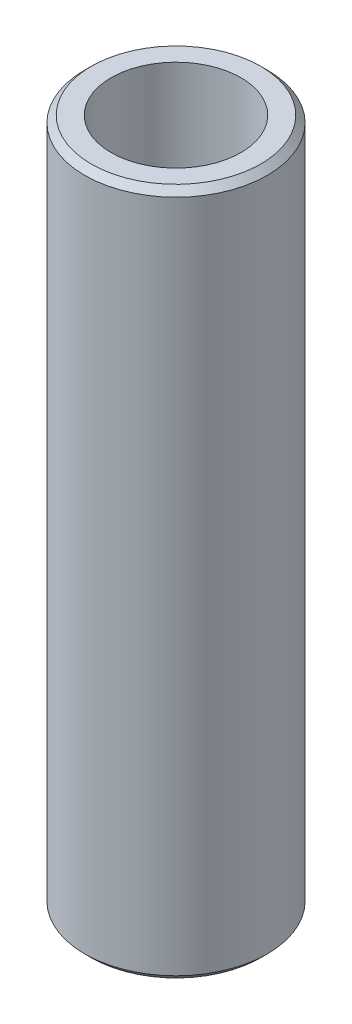
ISO-10303-21;
HEADER;
FILE_DESCRIPTION(('STEP AP214'),'2;1');
FILE_NAME('part.step','',(''),(''),'','','');
FILE_SCHEMA(('AUTOMOTIVE_DESIGN { 1 0 10303 214 1 1 1 1 }'));
ENDSEC;
DATA;
#1=APPLICATION_CONTEXT('core data for automotive mechanical design processes');
#2=APPLICATION_PROTOCOL_DEFINITION('international standard','automotive_design',2000,#1);
#3=PRODUCT_CONTEXT('',#1,'mechanical');
#4=PRODUCT('Part','Part','',(#3));
#5=PRODUCT_RELATED_PRODUCT_CATEGORY('part','',(#4));
#6=PRODUCT_DEFINITION_FORMATION('','',#4);
#7=PRODUCT_DEFINITION_CONTEXT('part definition',#1,'design');
#8=PRODUCT_DEFINITION('design','',#6,#7);
#9=PRODUCT_DEFINITION_SHAPE('','',#8);
#10=(LENGTH_UNIT() NAMED_UNIT(*) SI_UNIT(.MILLI.,.METRE.));
#11=(NAMED_UNIT(*) PLANE_ANGLE_UNIT() SI_UNIT($,.RADIAN.));
#12=(NAMED_UNIT(*) SI_UNIT($,.STERADIAN.) SOLID_ANGLE_UNIT());
#13=UNCERTAINTY_MEASURE_WITH_UNIT(LENGTH_MEASURE(1.E-05),#10,'distance_accuracy_value','');
#14=(GEOMETRIC_REPRESENTATION_CONTEXT(3) GLOBAL_UNCERTAINTY_ASSIGNED_CONTEXT((#13)) GLOBAL_UNIT_ASSIGNED_CONTEXT((#10,
#11,#12)) REPRESENTATION_CONTEXT('',''));
#15=CARTESIAN_POINT('',(0.,0.,0.));
#16=DIRECTION('',(0.,0.,1.));
#17=DIRECTION('',(1.,0.,0.));
#18=AXIS2_PLACEMENT_3D('',#15,#16,#17);
#19=CARTESIAN_POINT('',(0.,150.604492006929,0.));
#20=DIRECTION('',(0.,-1.,0.));
#21=DIRECTION('',(0.,0.,-1.));
#22=AXIS2_PLACEMENT_3D('',#19,#20,#21);
#23=CYLINDRICAL_SURFACE('',#22,20.);
#24=CARTESIAN_POINT('',(0.,149.168041895525,0.));
#25=DIRECTION('',(0.,1.,0.));
#26=DIRECTION('',(0.,0.,1.));
#27=AXIS2_PLACEMENT_3D('',#24,#25,#26);
#28=CIRCLE('',#27,20.);
#29=CARTESIAN_POINT('',(0.,149.168041895525,20.));
#30=VERTEX_POINT('',#29);
#31=EDGE_CURVE('E50',#30,#30,#28,.F.);
#32=ORIENTED_EDGE('',*,*,#31,.T.);
#33=EDGE_LOOP('',(#32));
#34=FACE_BOUND('',#33,.T.);
#35=CARTESIAN_POINT('',(0.,1.43645011140422,0.));
#36=DIRECTION('',(0.,1.,0.));
#37=DIRECTION('',(0.,0.,1.));
#38=AXIS2_PLACEMENT_3D('',#35,#36,#37);
#39=CIRCLE('',#38,20.);
#40=CARTESIAN_POINT('',(0.,1.43645011140422,20.));
#41=VERTEX_POINT('',#40);
#42=EDGE_CURVE('E51',#41,#41,#39,.T.);
#43=ORIENTED_EDGE('',*,*,#42,.T.);
#44=EDGE_LOOP('',(#43));
#45=FACE_BOUND('',#44,.T.);
#46=ADVANCED_FACE('F39',(#34,#45),#23,.T.);
#47=CARTESIAN_POINT('',(0.,150.604492006929,0.));
#48=DIRECTION('',(0.,1.,0.));
#49=DIRECTION('',(0.,0.,1.));
#50=AXIS2_PLACEMENT_3D('',#47,#48,#49);
#51=PLANE('',#50);
#52=CARTESIAN_POINT('',(0.,150.604492006929,0.));
#53=DIRECTION('',(0.,1.,0.));
#54=DIRECTION('',(0.,0.,1.));
#55=AXIS2_PLACEMENT_3D('',#52,#53,#54);
#56=CIRCLE('',#55,18.5635498885957);
#57=CARTESIAN_POINT('',(0.,150.604492006929,18.5635498885957));
#58=VERTEX_POINT('',#57);
#59=EDGE_CURVE('E54',#58,#58,#56,.T.);
#60=ORIENTED_EDGE('',*,*,#59,.T.);
#61=EDGE_LOOP('',(#60));
#62=FACE_BOUND('',#61,.T.);
#63=CARTESIAN_POINT('',(0.,150.604492006929,0.));
#64=DIRECTION('',(0.,1.,0.));
#65=DIRECTION('',(0.,0.,1.));
#66=AXIS2_PLACEMENT_3D('',#63,#64,#65);
#67=CIRCLE('',#66,14.2219479201406);
#68=CARTESIAN_POINT('',(0.,150.604492006929,14.2219479201406));
#69=VERTEX_POINT('',#68);
#70=EDGE_CURVE('E58',#69,#69,#67,.T.);
#71=ORIENTED_EDGE('',*,*,#70,.F.);
#72=EDGE_LOOP('',(#71));
#73=FACE_BOUND('',#72,.T.);
#74=ADVANCED_FACE('F69',(#62,#73),#51,.T.);
#75=CARTESIAN_POINT('',(0.,0.,0.));
#76=DIRECTION('',(0.,1.,0.));
#77=DIRECTION('',(0.,0.,1.));
#78=AXIS2_PLACEMENT_3D('',#75,#76,#77);
#79=PLANE('',#78);
#80=CARTESIAN_POINT('',(0.,0.,0.));
#81=DIRECTION('',(0.,1.,0.));
#82=DIRECTION('',(0.,0.,1.));
#83=AXIS2_PLACEMENT_3D('',#80,#81,#82);
#84=CIRCLE('',#83,18.5635498885958);
#85=CARTESIAN_POINT('',(0.,0.,18.5635498885958));
#86=VERTEX_POINT('',#85);
#87=EDGE_CURVE('E10',#86,#86,#84,.F.);
#88=ORIENTED_EDGE('',*,*,#87,.T.);
#89=EDGE_LOOP('',(#88));
#90=FACE_BOUND('',#89,.T.);
#91=CARTESIAN_POINT('',(0.,0.,0.));
#92=DIRECTION('',(0.,1.,0.));
#93=DIRECTION('',(0.,0.,1.));
#94=AXIS2_PLACEMENT_3D('',#91,#92,#93);
#95=CIRCLE('',#94,14.2219479201406);
#96=CARTESIAN_POINT('',(0.,0.,14.2219479201406));
#97=VERTEX_POINT('',#96);
#98=EDGE_CURVE('E63',#97,#97,#95,.T.);
#99=ORIENTED_EDGE('',*,*,#98,.T.);
#100=EDGE_LOOP('',(#99));
#101=FACE_BOUND('',#100,.T.);
#102=ADVANCED_FACE('F75',(#90,#101),#79,.F.);
#103=CARTESIAN_POINT('',(0.,150.604492006929,0.));
#104=DIRECTION('',(0.,-1.,0.));
#105=DIRECTION('',(0.,0.,-1.));
#106=AXIS2_PLACEMENT_3D('',#103,#104,#105);
#107=CYLINDRICAL_SURFACE('',#106,14.2219479201406);
#108=ORIENTED_EDGE('',*,*,#70,.T.);
#109=EDGE_LOOP('',(#108));
#110=FACE_BOUND('',#109,.T.);
#111=ORIENTED_EDGE('',*,*,#98,.F.);
#112=EDGE_LOOP('',(#111));
#113=FACE_BOUND('',#112,.T.);
#114=ADVANCED_FACE('F70',(#110,#113),#107,.F.);
#115=CARTESIAN_POINT('',(0.,150.604492006929,0.));
#116=DIRECTION('',(0.,-1.,0.));
#117=DIRECTION('',(0.,0.,-1.));
#118=AXIS2_PLACEMENT_3D('',#115,#116,#117);
#119=CONICAL_SURFACE('',#118,18.5635498885957,0.785398163397447);
#120=ORIENTED_EDGE('',*,*,#31,.F.);
#121=EDGE_LOOP('',(#120));
#122=FACE_BOUND('',#121,.T.);
#123=ORIENTED_EDGE('',*,*,#59,.F.);
#124=EDGE_LOOP('',(#123));
#125=FACE_BOUND('',#124,.T.);
#126=ADVANCED_FACE('F81',(#122,#125),#119,.T.);
#127=CARTESIAN_POINT('',(0.,1.43645011140422,0.));
#128=DIRECTION('',(0.,1.,0.));
#129=DIRECTION('',(0.,0.,1.));
#130=AXIS2_PLACEMENT_3D('',#127,#128,#129);
#131=CONICAL_SURFACE('',#130,20.,0.785398163397447);
#132=ORIENTED_EDGE('',*,*,#87,.F.);
#133=EDGE_LOOP('',(#132));
#134=FACE_BOUND('',#133,.T.);
#135=ORIENTED_EDGE('',*,*,#42,.F.);
#136=EDGE_LOOP('',(#135));
#137=FACE_BOUND('',#136,.T.);
#138=ADVANCED_FACE('F45',(#134,#137),#131,.T.);
#139=CLOSED_SHELL('',(#46,#74,#102,#114,#126,#138));
#140=MANIFOLD_SOLID_BREP('B2',#139);
#141=ADVANCED_BREP_SHAPE_REPRESENTATION('',(#18,#140),#14);
#142=SHAPE_DEFINITION_REPRESENTATION(#9,#141);
ENDSEC;
END-ISO-10303-21;
